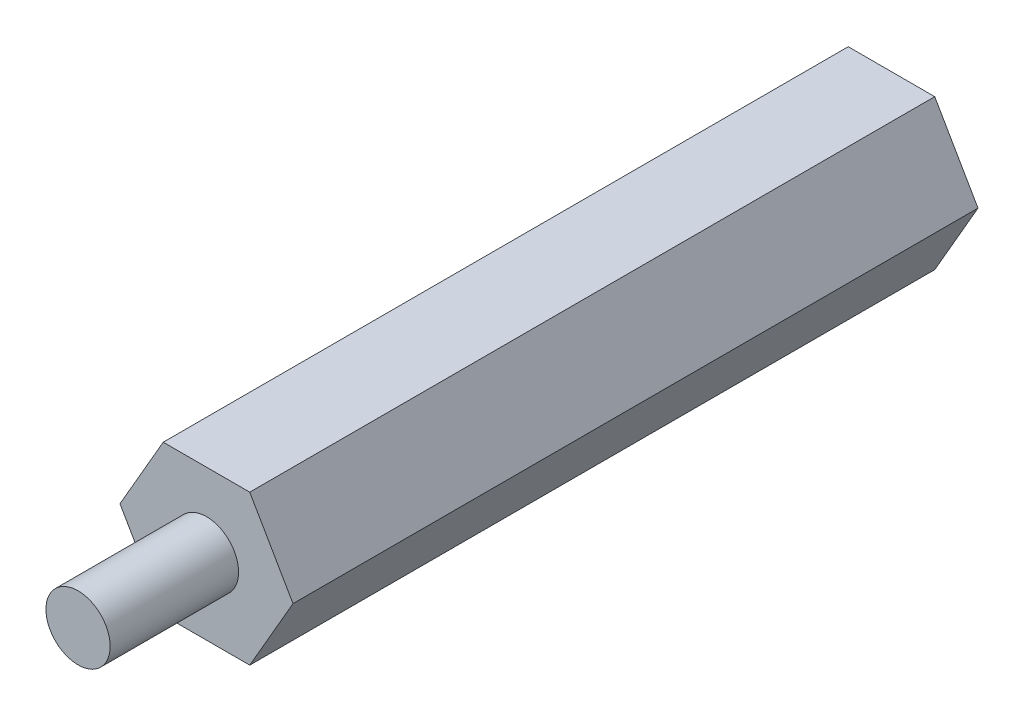
ISO-10303-21;
HEADER;
FILE_DESCRIPTION(('STEP AP214'),'2;1');
FILE_NAME('part.step','',(''),(''),'','','');
FILE_SCHEMA(('AUTOMOTIVE_DESIGN { 1 0 10303 214 1 1 1 1 }'));
ENDSEC;
DATA;
#1=APPLICATION_CONTEXT('core data for automotive mechanical design processes');
#2=APPLICATION_PROTOCOL_DEFINITION('international standard','automotive_design',2000,#1);
#3=PRODUCT_CONTEXT('',#1,'mechanical');
#4=PRODUCT('Part','Part','',(#3));
#5=PRODUCT_RELATED_PRODUCT_CATEGORY('part','',(#4));
#6=PRODUCT_DEFINITION_FORMATION('','',#4);
#7=PRODUCT_DEFINITION_CONTEXT('part definition',#1,'design');
#8=PRODUCT_DEFINITION('design','',#6,#7);
#9=PRODUCT_DEFINITION_SHAPE('','',#8);
#10=(LENGTH_UNIT() NAMED_UNIT(*) SI_UNIT(.MILLI.,.METRE.));
#11=(NAMED_UNIT(*) PLANE_ANGLE_UNIT() SI_UNIT($,.RADIAN.));
#12=(NAMED_UNIT(*) SI_UNIT($,.STERADIAN.) SOLID_ANGLE_UNIT());
#13=UNCERTAINTY_MEASURE_WITH_UNIT(LENGTH_MEASURE(1.E-05),#10,'distance_accuracy_value','');
#14=(GEOMETRIC_REPRESENTATION_CONTEXT(3) GLOBAL_UNCERTAINTY_ASSIGNED_CONTEXT((#13)) GLOBAL_UNIT_ASSIGNED_CONTEXT((#10,
#11,#12)) REPRESENTATION_CONTEXT('',''));
#15=CARTESIAN_POINT('',(0.,0.,0.));
#16=DIRECTION('',(0.,0.,1.));
#17=DIRECTION('',(1.,0.,0.));
#18=AXIS2_PLACEMENT_3D('',#15,#16,#17);
#19=CARTESIAN_POINT('',(2.0207259421637,-3.5,32.));
#20=DIRECTION('',(-0.866025403784439,0.5,0.));
#21=DIRECTION('',(-0.5,-0.866025403784439,0.));
#22=AXIS2_PLACEMENT_3D('',#19,#20,#21);
#23=PLANE('',#22);
#24=DIRECTION('',(0.5,0.866025403784439,0.));
#25=VECTOR('',#24,1.);
#26=CARTESIAN_POINT('',(2.0207259421637,-3.5,0.));
#27=LINE('',#26,#25);
#28=CARTESIAN_POINT('',(2.0207259421637,-3.5,0.));
#29=VERTEX_POINT('',#28);
#30=CARTESIAN_POINT('',(4.04145188432738,0.,0.));
#31=VERTEX_POINT('',#30);
#32=EDGE_CURVE('E125',#29,#31,#27,.T.);
#33=ORIENTED_EDGE('',*,*,#32,.T.);
#34=DIRECTION('',(0.,0.,-1.));
#35=VECTOR('',#34,1.);
#36=CARTESIAN_POINT('',(4.04145188432738,0.,32.));
#37=LINE('',#36,#35);
#38=CARTESIAN_POINT('',(4.04145188432738,0.,32.));
#39=VERTEX_POINT('',#38);
#40=EDGE_CURVE('E40',#39,#31,#37,.T.);
#41=ORIENTED_EDGE('',*,*,#40,.F.);
#42=DIRECTION('',(0.5,0.866025403784439,0.));
#43=VECTOR('',#42,1.);
#44=CARTESIAN_POINT('',(2.0207259421637,-3.5,32.));
#45=LINE('',#44,#43);
#46=CARTESIAN_POINT('',(2.0207259421637,-3.5,32.));
#47=VERTEX_POINT('',#46);
#48=EDGE_CURVE('E136',#47,#39,#45,.T.);
#49=ORIENTED_EDGE('',*,*,#48,.F.);
#50=DIRECTION('',(0.,0.,-1.));
#51=VECTOR('',#50,1.);
#52=CARTESIAN_POINT('',(2.0207259421637,-3.5,32.));
#53=LINE('',#52,#51);
#54=EDGE_CURVE('E121',#47,#29,#53,.T.);
#55=ORIENTED_EDGE('',*,*,#54,.T.);
#56=EDGE_LOOP('',(#33,#41,#49,#55));
#57=FACE_BOUND('',#56,.T.);
#58=ADVANCED_FACE('F37',(#57),#23,.F.);
#59=CARTESIAN_POINT('',(4.04145188432738,0.,32.));
#60=DIRECTION('',(-0.866025403784439,-0.5,0.));
#61=DIRECTION('',(0.5,-0.866025403784439,0.));
#62=AXIS2_PLACEMENT_3D('',#59,#60,#61);
#63=PLANE('',#62);
#64=DIRECTION('',(-0.5,0.866025403784439,0.));
#65=VECTOR('',#64,1.);
#66=CARTESIAN_POINT('',(4.04145188432738,0.,0.));
#67=LINE('',#66,#65);
#68=CARTESIAN_POINT('',(2.02072594216369,3.5,0.));
#69=VERTEX_POINT('',#68);
#70=EDGE_CURVE('E128',#31,#69,#67,.T.);
#71=ORIENTED_EDGE('',*,*,#70,.T.);
#72=DIRECTION('',(0.,0.,-1.));
#73=VECTOR('',#72,1.);
#74=CARTESIAN_POINT('',(2.02072594216369,3.5,32.));
#75=LINE('',#74,#73);
#76=CARTESIAN_POINT('',(2.02072594216369,3.5,32.));
#77=VERTEX_POINT('',#76);
#78=EDGE_CURVE('E139',#77,#69,#75,.T.);
#79=ORIENTED_EDGE('',*,*,#78,.F.);
#80=DIRECTION('',(-0.5,0.866025403784439,0.));
#81=VECTOR('',#80,1.);
#82=CARTESIAN_POINT('',(4.04145188432738,0.,32.));
#83=LINE('',#82,#81);
#84=EDGE_CURVE('E93',#39,#77,#83,.T.);
#85=ORIENTED_EDGE('',*,*,#84,.F.);
#86=ORIENTED_EDGE('',*,*,#40,.T.);
#87=EDGE_LOOP('',(#71,#79,#85,#86));
#88=FACE_BOUND('',#87,.T.);
#89=ADVANCED_FACE('F144',(#88),#63,.F.);
#90=CARTESIAN_POINT('',(2.02072594216369,3.5,32.));
#91=DIRECTION('',(0.,-1.,0.));
#92=DIRECTION('',(1.,0.,0.));
#93=AXIS2_PLACEMENT_3D('',#90,#91,#92);
#94=PLANE('',#93);
#95=DIRECTION('',(-1.,0.,0.));
#96=VECTOR('',#95,1.);
#97=CARTESIAN_POINT('',(2.02072594216369,3.5,0.));
#98=LINE('',#97,#96);
#99=CARTESIAN_POINT('',(-2.02072594216369,3.5,0.));
#100=VERTEX_POINT('',#99);
#101=EDGE_CURVE('E131',#69,#100,#98,.T.);
#102=ORIENTED_EDGE('',*,*,#101,.T.);
#103=DIRECTION('',(0.,0.,-1.));
#104=VECTOR('',#103,1.);
#105=CARTESIAN_POINT('',(-2.02072594216369,3.5,32.));
#106=LINE('',#105,#104);
#107=CARTESIAN_POINT('',(-2.02072594216369,3.5,32.));
#108=VERTEX_POINT('',#107);
#109=EDGE_CURVE('E116',#108,#100,#106,.T.);
#110=ORIENTED_EDGE('',*,*,#109,.F.);
#111=DIRECTION('',(-1.,0.,0.));
#112=VECTOR('',#111,1.);
#113=CARTESIAN_POINT('',(2.02072594216369,3.5,32.));
#114=LINE('',#113,#112);
#115=EDGE_CURVE('E107',#77,#108,#114,.T.);
#116=ORIENTED_EDGE('',*,*,#115,.F.);
#117=ORIENTED_EDGE('',*,*,#78,.T.);
#118=EDGE_LOOP('',(#102,#110,#116,#117));
#119=FACE_BOUND('',#118,.T.);
#120=ADVANCED_FACE('F150',(#119),#94,.F.);
#121=CARTESIAN_POINT('',(-2.02072594216369,3.5,32.));
#122=DIRECTION('',(0.866025403784439,-0.5,0.));
#123=DIRECTION('',(0.5,0.866025403784439,0.));
#124=AXIS2_PLACEMENT_3D('',#121,#122,#123);
#125=PLANE('',#124);
#126=DIRECTION('',(-0.5,-0.866025403784438,0.));
#127=VECTOR('',#126,1.);
#128=CARTESIAN_POINT('',(-2.02072594216369,3.5,0.));
#129=LINE('',#128,#127);
#130=CARTESIAN_POINT('',(-4.04145188432738,0.,0.));
#131=VERTEX_POINT('',#130);
#132=EDGE_CURVE('E115',#100,#131,#129,.T.);
#133=ORIENTED_EDGE('',*,*,#132,.T.);
#134=DIRECTION('',(0.,0.,-1.));
#135=VECTOR('',#134,1.);
#136=CARTESIAN_POINT('',(-4.04145188432738,0.,32.));
#137=LINE('',#136,#135);
#138=CARTESIAN_POINT('',(-4.04145188432738,0.,32.));
#139=VERTEX_POINT('',#138);
#140=EDGE_CURVE('E112',#139,#131,#137,.T.);
#141=ORIENTED_EDGE('',*,*,#140,.F.);
#142=DIRECTION('',(-0.5,-0.866025403784438,0.));
#143=VECTOR('',#142,1.);
#144=CARTESIAN_POINT('',(-2.02072594216369,3.5,32.));
#145=LINE('',#144,#143);
#146=EDGE_CURVE('E101',#108,#139,#145,.T.);
#147=ORIENTED_EDGE('',*,*,#146,.F.);
#148=ORIENTED_EDGE('',*,*,#109,.T.);
#149=EDGE_LOOP('',(#133,#141,#147,#148));
#150=FACE_BOUND('',#149,.T.);
#151=ADVANCED_FACE('F113',(#150),#125,.F.);
#152=CARTESIAN_POINT('',(-4.04145188432738,0.,32.));
#153=DIRECTION('',(0.866025403784439,0.5,0.));
#154=DIRECTION('',(-0.5,0.866025403784439,0.));
#155=AXIS2_PLACEMENT_3D('',#152,#153,#154);
#156=PLANE('',#155);
#157=DIRECTION('',(0.5,-0.866025403784439,0.));
#158=VECTOR('',#157,1.);
#159=CARTESIAN_POINT('',(-4.04145188432738,0.,0.));
#160=LINE('',#159,#158);
#161=CARTESIAN_POINT('',(-2.02072594216369,-3.5,0.));
#162=VERTEX_POINT('',#161);
#163=EDGE_CURVE('E78',#131,#162,#160,.T.);
#164=ORIENTED_EDGE('',*,*,#163,.T.);
#165=DIRECTION('',(0.,0.,-1.));
#166=VECTOR('',#165,1.);
#167=CARTESIAN_POINT('',(-2.02072594216369,-3.5,32.));
#168=LINE('',#167,#166);
#169=CARTESIAN_POINT('',(-2.02072594216369,-3.5,32.));
#170=VERTEX_POINT('',#169);
#171=EDGE_CURVE('E117',#170,#162,#168,.T.);
#172=ORIENTED_EDGE('',*,*,#171,.F.);
#173=DIRECTION('',(0.5,-0.866025403784439,0.));
#174=VECTOR('',#173,1.);
#175=CARTESIAN_POINT('',(-4.04145188432738,0.,32.));
#176=LINE('',#175,#174);
#177=EDGE_CURVE('E105',#139,#170,#176,.T.);
#178=ORIENTED_EDGE('',*,*,#177,.F.);
#179=ORIENTED_EDGE('',*,*,#140,.T.);
#180=EDGE_LOOP('',(#164,#172,#178,#179));
#181=FACE_BOUND('',#180,.T.);
#182=ADVANCED_FACE('F119',(#181),#156,.F.);
#183=CARTESIAN_POINT('',(-2.02072594216369,-3.5,32.));
#184=DIRECTION('',(0.,1.,0.));
#185=DIRECTION('',(-1.,0.,0.));
#186=AXIS2_PLACEMENT_3D('',#183,#184,#185);
#187=PLANE('',#186);
#188=DIRECTION('',(1.,0.,0.));
#189=VECTOR('',#188,1.);
#190=CARTESIAN_POINT('',(-2.02072594216369,-3.5,0.));
#191=LINE('',#190,#189);
#192=EDGE_CURVE('E84',#162,#29,#191,.T.);
#193=ORIENTED_EDGE('',*,*,#192,.T.);
#194=ORIENTED_EDGE('',*,*,#54,.F.);
#195=DIRECTION('',(1.,0.,0.));
#196=VECTOR('',#195,1.);
#197=CARTESIAN_POINT('',(-2.02072594216369,-3.5,32.));
#198=LINE('',#197,#196);
#199=EDGE_CURVE('E54',#170,#47,#198,.T.);
#200=ORIENTED_EDGE('',*,*,#199,.F.);
#201=ORIENTED_EDGE('',*,*,#171,.T.);
#202=EDGE_LOOP('',(#193,#194,#200,#201));
#203=FACE_BOUND('',#202,.T.);
#204=ADVANCED_FACE('F175',(#203),#187,.F.);
#205=CARTESIAN_POINT('',(0.,0.,32.));
#206=DIRECTION('',(0.,0.,1.));
#207=DIRECTION('',(1.,0.,0.));
#208=AXIS2_PLACEMENT_3D('',#205,#206,#207);
#209=PLANE('',#208);
#210=CARTESIAN_POINT('',(0.,0.,32.));
#211=DIRECTION('',(0.,0.,1.));
#212=DIRECTION('',(1.,0.,0.));
#213=AXIS2_PLACEMENT_3D('',#210,#211,#212);
#214=CIRCLE('',#213,1.5);
#215=CARTESIAN_POINT('',(1.5,0.,32.));
#216=VERTEX_POINT('',#215);
#217=EDGE_CURVE('E11',#216,#216,#214,.T.);
#218=ORIENTED_EDGE('',*,*,#217,.F.);
#219=EDGE_LOOP('',(#218));
#220=FACE_BOUND('',#219,.T.);
#221=ORIENTED_EDGE('',*,*,#48,.T.);
#222=ORIENTED_EDGE('',*,*,#84,.T.);
#223=ORIENTED_EDGE('',*,*,#115,.T.);
#224=ORIENTED_EDGE('',*,*,#146,.T.);
#225=ORIENTED_EDGE('',*,*,#177,.T.);
#226=ORIENTED_EDGE('',*,*,#199,.T.);
#227=EDGE_LOOP('',(#221,#222,#223,#224,#225,#226));
#228=FACE_BOUND('',#227,.T.);
#229=ADVANCED_FACE('F103',(#220,#228),#209,.T.);
#230=CARTESIAN_POINT('',(0.,0.,0.));
#231=DIRECTION('',(0.,0.,1.));
#232=DIRECTION('',(1.,0.,0.));
#233=AXIS2_PLACEMENT_3D('',#230,#231,#232);
#234=PLANE('',#233);
#235=CARTESIAN_POINT('',(0.,0.,0.));
#236=DIRECTION('',(0.,0.,-1.));
#237=DIRECTION('',(-1.,0.,0.));
#238=AXIS2_PLACEMENT_3D('',#235,#236,#237);
#239=CIRCLE('',#238,1.24999999999999);
#240=CARTESIAN_POINT('',(-1.24999999999999,0.,0.));
#241=VERTEX_POINT('',#240);
#242=EDGE_CURVE('E159',#241,#241,#239,.T.);
#243=ORIENTED_EDGE('',*,*,#242,.F.);
#244=EDGE_LOOP('',(#243));
#245=FACE_BOUND('',#244,.T.);
#246=ORIENTED_EDGE('',*,*,#32,.F.);
#247=ORIENTED_EDGE('',*,*,#192,.F.);
#248=ORIENTED_EDGE('',*,*,#163,.F.);
#249=ORIENTED_EDGE('',*,*,#132,.F.);
#250=ORIENTED_EDGE('',*,*,#101,.F.);
#251=ORIENTED_EDGE('',*,*,#70,.F.);
#252=EDGE_LOOP('',(#246,#247,#248,#249,#250,#251));
#253=FACE_BOUND('',#252,.T.);
#254=ADVANCED_FACE('F149',(#245,#253),#234,.F.);
#255=CARTESIAN_POINT('',(0.,0.,38.));
#256=DIRECTION('',(0.,0.,-1.));
#257=DIRECTION('',(-1.,0.,0.));
#258=AXIS2_PLACEMENT_3D('',#255,#256,#257);
#259=CYLINDRICAL_SURFACE('',#258,1.5);
#260=CARTESIAN_POINT('',(0.,0.,38.));
#261=DIRECTION('',(0.,0.,1.));
#262=DIRECTION('',(1.,0.,0.));
#263=AXIS2_PLACEMENT_3D('',#260,#261,#262);
#264=CIRCLE('',#263,1.5);
#265=CARTESIAN_POINT('',(1.5,0.,38.));
#266=VERTEX_POINT('',#265);
#267=EDGE_CURVE('E129',#266,#266,#264,.T.);
#268=ORIENTED_EDGE('',*,*,#267,.F.);
#269=EDGE_LOOP('',(#268));
#270=FACE_BOUND('',#269,.T.);
#271=ORIENTED_EDGE('',*,*,#217,.T.);
#272=EDGE_LOOP('',(#271));
#273=FACE_BOUND('',#272,.T.);
#274=ADVANCED_FACE('F166',(#270,#273),#259,.T.);
#275=CARTESIAN_POINT('',(0.,0.,38.));
#276=DIRECTION('',(0.,0.,1.));
#277=DIRECTION('',(1.,0.,0.));
#278=AXIS2_PLACEMENT_3D('',#275,#276,#277);
#279=PLANE('',#278);
#280=ORIENTED_EDGE('',*,*,#267,.T.);
#281=EDGE_LOOP('',(#280));
#282=FACE_BOUND('',#281,.T.);
#283=ADVANCED_FACE('F172',(#282),#279,.T.);
#284=CARTESIAN_POINT('',(0.,0.,3.9));
#285=DIRECTION('',(0.,0.,-1.));
#286=DIRECTION('',(-1.,0.,0.));
#287=AXIS2_PLACEMENT_3D('',#284,#285,#286);
#288=CONICAL_SURFACE('',#287,1.25,1.02974425867665);
#289=CARTESIAN_POINT('',(0.,0.,4.65107577378445));
#290=VERTEX_POINT('',#289);
#291=VERTEX_LOOP('',#290);
#292=FACE_BOUND('',#291,.T.);
#293=CARTESIAN_POINT('',(0.,0.,3.9));
#294=DIRECTION('',(0.,0.,-1.));
#295=DIRECTION('',(-1.,0.,0.));
#296=AXIS2_PLACEMENT_3D('',#293,#294,#295);
#297=CIRCLE('',#296,1.25);
#298=CARTESIAN_POINT('',(-1.25,0.,3.9));
#299=VERTEX_POINT('',#298);
#300=EDGE_CURVE('E156',#299,#299,#297,.T.);
#301=ORIENTED_EDGE('',*,*,#300,.T.);
#302=EDGE_LOOP('',(#301));
#303=FACE_BOUND('',#302,.T.);
#304=ADVANCED_FACE('F217',(#292,#303),#288,.F.);
#305=CARTESIAN_POINT('',(0.,0.,0.));
#306=DIRECTION('',(0.,0.,-1.));
#307=DIRECTION('',(-1.,0.,0.));
#308=AXIS2_PLACEMENT_3D('',#305,#306,#307);
#309=CYLINDRICAL_SURFACE('',#308,1.24999999999999);
#310=ORIENTED_EDGE('',*,*,#300,.F.);
#311=EDGE_LOOP('',(#310));
#312=FACE_BOUND('',#311,.T.);
#313=ORIENTED_EDGE('',*,*,#242,.T.);
#314=EDGE_LOOP('',(#313));
#315=FACE_BOUND('',#314,.T.);
#316=ADVANCED_FACE('F163',(#312,#315),#309,.F.);
#317=CLOSED_SHELL('',(#58,#89,#120,#151,#182,#204,#229,#254,#274,#283,#304,#316));
#318=MANIFOLD_SOLID_BREP('B2',#317);
#319=ADVANCED_BREP_SHAPE_REPRESENTATION('',(#18,#318),#14);
#320=SHAPE_DEFINITION_REPRESENTATION(#9,#319);
ENDSEC;
END-ISO-10303-21;
